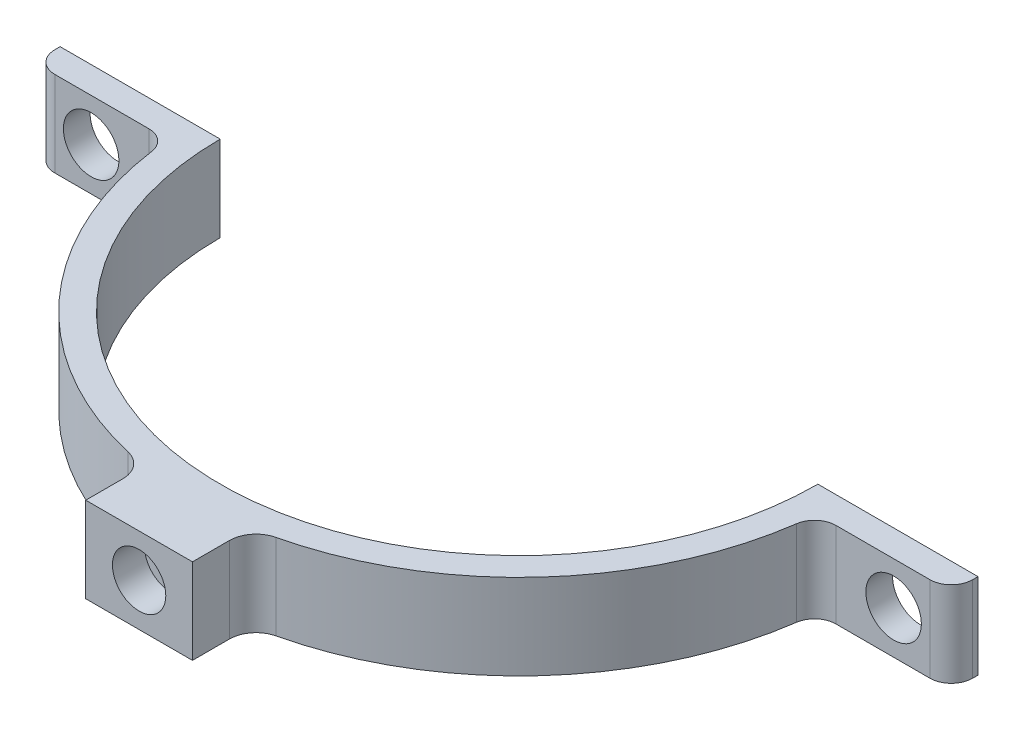
ISO-10303-21;
HEADER;
FILE_DESCRIPTION(('STEP AP214'),'2;1');
FILE_NAME('part.step','',(''),(''),'','','');
FILE_SCHEMA(('AUTOMOTIVE_DESIGN { 1 0 10303 214 1 1 1 1 }'));
ENDSEC;
DATA;
#1=APPLICATION_CONTEXT('core data for automotive mechanical design processes');
#2=APPLICATION_PROTOCOL_DEFINITION('international standard','automotive_design',2000,#1);
#3=PRODUCT_CONTEXT('',#1,'mechanical');
#4=PRODUCT('Part','Part','',(#3));
#5=PRODUCT_RELATED_PRODUCT_CATEGORY('part','',(#4));
#6=PRODUCT_DEFINITION_FORMATION('','',#4);
#7=PRODUCT_DEFINITION_CONTEXT('part definition',#1,'design');
#8=PRODUCT_DEFINITION('design','',#6,#7);
#9=PRODUCT_DEFINITION_SHAPE('','',#8);
#10=(LENGTH_UNIT() NAMED_UNIT(*) SI_UNIT(.MILLI.,.METRE.));
#11=(NAMED_UNIT(*) PLANE_ANGLE_UNIT() SI_UNIT($,.RADIAN.));
#12=(NAMED_UNIT(*) SI_UNIT($,.STERADIAN.) SOLID_ANGLE_UNIT());
#13=UNCERTAINTY_MEASURE_WITH_UNIT(LENGTH_MEASURE(1.E-05),#10,'distance_accuracy_value','');
#14=(GEOMETRIC_REPRESENTATION_CONTEXT(3) GLOBAL_UNCERTAINTY_ASSIGNED_CONTEXT((#13)) GLOBAL_UNIT_ASSIGNED_CONTEXT((#10,
#11,#12)) REPRESENTATION_CONTEXT('',''));
#15=CARTESIAN_POINT('',(0.,0.,0.));
#16=DIRECTION('',(0.,0.,1.));
#17=DIRECTION('',(1.,0.,0.));
#18=AXIS2_PLACEMENT_3D('',#15,#16,#17);
#19=CARTESIAN_POINT('',(0.,10.16,0.));
#20=DIRECTION('',(0.,-1.,0.));
#21=DIRECTION('',(0.,0.,-1.));
#22=AXIS2_PLACEMENT_3D('',#19,#20,#21);
#23=CYLINDRICAL_SURFACE('',#22,38.735);
#24=CARTESIAN_POINT('',(0.,0.,0.));
#25=DIRECTION('',(0.,1.,0.));
#26=DIRECTION('',(0.,0.,1.));
#27=AXIS2_PLACEMENT_3D('',#24,#25,#26);
#28=CIRCLE('',#27,38.735);
#29=CARTESIAN_POINT('',(-38.3618971845454,0.,5.36330769230769));
#30=VERTEX_POINT('',#29);
#31=CARTESIAN_POINT('',(-8.80340909090909,0.,37.7213495699464));
#32=VERTEX_POINT('',#31);
#33=EDGE_CURVE('E238',#30,#32,#28,.T.);
#34=ORIENTED_EDGE('',*,*,#33,.T.);
#35=DIRECTION('',(0.,-1.,0.));
#36=VECTOR('',#35,1.);
#37=CARTESIAN_POINT('',(-8.80340909090909,10.16,37.7213495699464));
#38=LINE('',#37,#36);
#39=CARTESIAN_POINT('',(-8.80340909090909,10.16,37.7213495699464));
#40=VERTEX_POINT('',#39);
#41=EDGE_CURVE('E305',#32,#40,#38,.F.);
#42=ORIENTED_EDGE('',*,*,#41,.T.);
#43=CARTESIAN_POINT('',(0.,10.16,0.));
#44=DIRECTION('',(0.,1.,0.));
#45=DIRECTION('',(0.,0.,1.));
#46=AXIS2_PLACEMENT_3D('',#43,#44,#45);
#47=CIRCLE('',#46,38.735);
#48=CARTESIAN_POINT('',(-38.3618971845454,10.16,5.36330769230769));
#49=VERTEX_POINT('',#48);
#50=EDGE_CURVE('E217',#49,#40,#47,.T.);
#51=ORIENTED_EDGE('',*,*,#50,.F.);
#52=DIRECTION('',(0.,-1.,0.));
#53=VECTOR('',#52,1.);
#54=CARTESIAN_POINT('',(-38.3618971845454,10.16,5.36330769230769));
#55=LINE('',#54,#53);
#56=EDGE_CURVE('E263',#49,#30,#55,.T.);
#57=ORIENTED_EDGE('',*,*,#56,.T.);
#58=EDGE_LOOP('',(#34,#42,#51,#57));
#59=FACE_BOUND('',#58,.T.);
#60=ADVANCED_FACE('F36',(#59),#23,.T.);
#61=CARTESIAN_POINT('',(-54.61,10.16,0.));
#62=DIRECTION('',(0.,0.,1.));
#63=DIRECTION('',(1.,0.,0.));
#64=AXIS2_PLACEMENT_3D('',#61,#62,#63);
#65=PLANE('',#64);
#66=CARTESIAN_POINT('',(-47.7437157130775,5.08,0.));
#67=DIRECTION('',(0.,0.,1.));
#68=DIRECTION('',(1.,0.,0.));
#69=AXIS2_PLACEMENT_3D('',#66,#67,#68);
#70=CIRCLE('',#69,3.302);
#71=CARTESIAN_POINT('',(-44.4417157130775,5.08,0.));
#72=VERTEX_POINT('',#71);
#73=EDGE_CURVE('E204',#72,#72,#70,.T.);
#74=ORIENTED_EDGE('',*,*,#73,.T.);
#75=EDGE_LOOP('',(#74));
#76=FACE_BOUND('',#75,.T.);
#77=DIRECTION('',(-1.,0.,0.));
#78=VECTOR('',#77,1.);
#79=CARTESIAN_POINT('',(-54.61,0.,0.));
#80=LINE('',#79,#78);
#81=CARTESIAN_POINT('',(-35.56,0.,0.));
#82=VERTEX_POINT('',#81);
#83=CARTESIAN_POINT('',(-54.61,0.,0.));
#84=VERTEX_POINT('',#83);
#85=EDGE_CURVE('E207',#82,#84,#80,.T.);
#86=ORIENTED_EDGE('',*,*,#85,.T.);
#87=DIRECTION('',(0.,-1.,0.));
#88=VECTOR('',#87,1.);
#89=CARTESIAN_POINT('',(-54.61,10.16,0.));
#90=LINE('',#89,#88);
#91=CARTESIAN_POINT('',(-54.61,10.16,0.));
#92=VERTEX_POINT('',#91);
#93=EDGE_CURVE('E257',#92,#84,#90,.T.);
#94=ORIENTED_EDGE('',*,*,#93,.F.);
#95=DIRECTION('',(-1.,0.,0.));
#96=VECTOR('',#95,1.);
#97=CARTESIAN_POINT('',(-54.61,10.16,0.));
#98=LINE('',#97,#96);
#99=CARTESIAN_POINT('',(-35.56,10.16,0.));
#100=VERTEX_POINT('',#99);
#101=EDGE_CURVE('E208',#100,#92,#98,.T.);
#102=ORIENTED_EDGE('',*,*,#101,.F.);
#103=DIRECTION('',(0.,-1.,0.));
#104=VECTOR('',#103,1.);
#105=CARTESIAN_POINT('',(-35.56,10.16,0.));
#106=LINE('',#105,#104);
#107=EDGE_CURVE('E229',#100,#82,#106,.T.);
#108=ORIENTED_EDGE('',*,*,#107,.T.);
#109=EDGE_LOOP('',(#86,#94,#102,#108));
#110=FACE_BOUND('',#109,.T.);
#111=ADVANCED_FACE('F346',(#76,#110),#65,.F.);
#112=CARTESIAN_POINT('',(-54.61,10.16,0.));
#113=DIRECTION('',(1.,0.,0.));
#114=DIRECTION('',(0.,0.,-1.));
#115=AXIS2_PLACEMENT_3D('',#112,#113,#114);
#116=PLANE('',#115);
#117=DIRECTION('',(0.,0.,1.));
#118=VECTOR('',#117,1.);
#119=CARTESIAN_POINT('',(-54.61,0.,0.));
#120=LINE('',#119,#118);
#121=CARTESIAN_POINT('',(-54.61,0.,0.635));
#122=VERTEX_POINT('',#121);
#123=EDGE_CURVE('E232',#84,#122,#120,.T.);
#124=ORIENTED_EDGE('',*,*,#123,.T.);
#125=DIRECTION('',(0.,-1.,0.));
#126=VECTOR('',#125,1.);
#127=CARTESIAN_POINT('',(-54.61,10.16,0.635));
#128=LINE('',#127,#126);
#129=CARTESIAN_POINT('',(-54.61,10.16,0.635));
#130=VERTEX_POINT('',#129);
#131=EDGE_CURVE('E291',#122,#130,#128,.F.);
#132=ORIENTED_EDGE('',*,*,#131,.T.);
#133=DIRECTION('',(0.,0.,1.));
#134=VECTOR('',#133,1.);
#135=CARTESIAN_POINT('',(-54.61,10.16,0.));
#136=LINE('',#135,#134);
#137=EDGE_CURVE('E211',#92,#130,#136,.T.);
#138=ORIENTED_EDGE('',*,*,#137,.F.);
#139=ORIENTED_EDGE('',*,*,#93,.T.);
#140=EDGE_LOOP('',(#124,#132,#138,#139));
#141=FACE_BOUND('',#140,.T.);
#142=ADVANCED_FACE('F340',(#141),#116,.F.);
#143=CARTESIAN_POINT('',(-54.61,10.16,3.175));
#144=DIRECTION('',(0.,0.,-1.));
#145=DIRECTION('',(-1.,0.,0.));
#146=AXIS2_PLACEMENT_3D('',#143,#144,#145);
#147=PLANE('',#146);
#148=CARTESIAN_POINT('',(-47.7437157130775,5.08,3.175));
#149=DIRECTION('',(0.,0.,1.));
#150=DIRECTION('',(1.,0.,0.));
#151=AXIS2_PLACEMENT_3D('',#148,#149,#150);
#152=CIRCLE('',#151,3.302);
#153=CARTESIAN_POINT('',(-44.4417157130775,5.08,3.175));
#154=VERTEX_POINT('',#153);
#155=EDGE_CURVE('E201',#154,#154,#152,.T.);
#156=ORIENTED_EDGE('',*,*,#155,.F.);
#157=EDGE_LOOP('',(#156));
#158=FACE_BOUND('',#157,.T.);
#159=DIRECTION('',(1.,0.,0.));
#160=VECTOR('',#159,1.);
#161=CARTESIAN_POINT('',(-54.61,10.16,3.175));
#162=LINE('',#161,#160);
#163=CARTESIAN_POINT('',(-52.07,10.16,3.175));
#164=VERTEX_POINT('',#163);
#165=CARTESIAN_POINT('',(-40.8774314261549,10.16,3.175));
#166=VERTEX_POINT('',#165);
#167=EDGE_CURVE('E214',#164,#166,#162,.T.);
#168=ORIENTED_EDGE('',*,*,#167,.F.);
#169=DIRECTION('',(0.,-1.,0.));
#170=VECTOR('',#169,1.);
#171=CARTESIAN_POINT('',(-52.07,10.16,3.175));
#172=LINE('',#171,#170);
#173=CARTESIAN_POINT('',(-52.07,0.,3.175));
#174=VERTEX_POINT('',#173);
#175=EDGE_CURVE('E282',#164,#174,#172,.T.);
#176=ORIENTED_EDGE('',*,*,#175,.T.);
#177=DIRECTION('',(1.,0.,0.));
#178=VECTOR('',#177,1.);
#179=CARTESIAN_POINT('',(-54.61,0.,3.175));
#180=LINE('',#179,#178);
#181=CARTESIAN_POINT('',(-40.8774314261549,0.,3.175));
#182=VERTEX_POINT('',#181);
#183=EDGE_CURVE('E235',#174,#182,#180,.T.);
#184=ORIENTED_EDGE('',*,*,#183,.T.);
#185=DIRECTION('',(0.,1.,0.));
#186=VECTOR('',#185,1.);
#187=CARTESIAN_POINT('',(-40.8774314261549,10.16,3.175));
#188=LINE('',#187,#186);
#189=EDGE_CURVE('E269',#182,#166,#188,.T.);
#190=ORIENTED_EDGE('',*,*,#189,.T.);
#191=EDGE_LOOP('',(#168,#176,#184,#190));
#192=FACE_BOUND('',#191,.T.);
#193=ADVANCED_FACE('F333',(#158,#192),#147,.F.);
#194=CARTESIAN_POINT('',(8.80340909090909,10.16,37.7213495699464));
#195=VERTEX_POINT('',#194);
#196=CARTESIAN_POINT('',(38.3618971845454,10.16,5.36330769230769));
#197=VERTEX_POINT('',#196);
#198=EDGE_CURVE('E216',#195,#197,#47,.T.);
#199=ORIENTED_EDGE('',*,*,#198,.F.);
#200=DIRECTION('',(0.,-1.,0.));
#201=VECTOR('',#200,1.);
#202=CARTESIAN_POINT('',(8.80340909090909,10.16,37.7213495699464));
#203=LINE('',#202,#201);
#204=CARTESIAN_POINT('',(8.80340909090909,0.,37.7213495699464));
#205=VERTEX_POINT('',#204);
#206=EDGE_CURVE('E51',#195,#205,#203,.T.);
#207=ORIENTED_EDGE('',*,*,#206,.T.);
#208=CARTESIAN_POINT('',(38.3618971845454,0.,5.36330769230769));
#209=VERTEX_POINT('',#208);
#210=EDGE_CURVE('E237',#205,#209,#28,.T.);
#211=ORIENTED_EDGE('',*,*,#210,.T.);
#212=DIRECTION('',(0.,-1.,0.));
#213=VECTOR('',#212,1.);
#214=CARTESIAN_POINT('',(38.3618971845454,10.16,5.36330769230769));
#215=LINE('',#214,#213);
#216=EDGE_CURVE('E266',#209,#197,#215,.F.);
#217=ORIENTED_EDGE('',*,*,#216,.T.);
#218=EDGE_LOOP('',(#199,#207,#211,#217));
#219=FACE_BOUND('',#218,.T.);
#220=ADVANCED_FACE('F388',(#219),#23,.T.);
#221=CARTESIAN_POINT('',(54.61,10.16,3.175));
#222=DIRECTION('',(0.,0.,-1.));
#223=DIRECTION('',(-1.,0.,0.));
#224=AXIS2_PLACEMENT_3D('',#221,#222,#223);
#225=PLANE('',#224);
#226=CARTESIAN_POINT('',(47.7437157130775,5.08,3.175));
#227=DIRECTION('',(0.,0.,1.));
#228=DIRECTION('',(-1.,0.,0.));
#229=AXIS2_PLACEMENT_3D('',#226,#227,#228);
#230=CIRCLE('',#229,3.302);
#231=CARTESIAN_POINT('',(44.4417157130775,5.08,3.175));
#232=VERTEX_POINT('',#231);
#233=EDGE_CURVE('E196',#232,#232,#230,.T.);
#234=ORIENTED_EDGE('',*,*,#233,.F.);
#235=EDGE_LOOP('',(#234));
#236=FACE_BOUND('',#235,.T.);
#237=DIRECTION('',(1.,0.,0.));
#238=VECTOR('',#237,1.);
#239=CARTESIAN_POINT('',(54.61,0.,3.175));
#240=LINE('',#239,#238);
#241=CARTESIAN_POINT('',(40.8774314261549,0.,3.175));
#242=VERTEX_POINT('',#241);
#243=CARTESIAN_POINT('',(52.07,0.,3.175));
#244=VERTEX_POINT('',#243);
#245=EDGE_CURVE('E241',#242,#244,#240,.T.);
#246=ORIENTED_EDGE('',*,*,#245,.T.);
#247=DIRECTION('',(0.,-1.,0.));
#248=VECTOR('',#247,1.);
#249=CARTESIAN_POINT('',(52.07,10.16,3.175));
#250=LINE('',#249,#248);
#251=CARTESIAN_POINT('',(52.07,10.16,3.175));
#252=VERTEX_POINT('',#251);
#253=EDGE_CURVE('E300',#244,#252,#250,.F.);
#254=ORIENTED_EDGE('',*,*,#253,.T.);
#255=DIRECTION('',(1.,0.,0.));
#256=VECTOR('',#255,1.);
#257=CARTESIAN_POINT('',(54.61,10.16,3.175));
#258=LINE('',#257,#256);
#259=CARTESIAN_POINT('',(40.8774314261549,10.16,3.175));
#260=VERTEX_POINT('',#259);
#261=EDGE_CURVE('E220',#260,#252,#258,.T.);
#262=ORIENTED_EDGE('',*,*,#261,.F.);
#263=DIRECTION('',(0.,1.,0.));
#264=VECTOR('',#263,1.);
#265=CARTESIAN_POINT('',(40.8774314261549,0.,3.175));
#266=LINE('',#265,#264);
#267=EDGE_CURVE('E260',#260,#242,#266,.F.);
#268=ORIENTED_EDGE('',*,*,#267,.T.);
#269=EDGE_LOOP('',(#246,#254,#262,#268));
#270=FACE_BOUND('',#269,.T.);
#271=ADVANCED_FACE('F366',(#236,#270),#225,.F.);
#272=CARTESIAN_POINT('',(54.61,10.16,0.));
#273=DIRECTION('',(-1.,0.,0.));
#274=DIRECTION('',(0.,0.,1.));
#275=AXIS2_PLACEMENT_3D('',#272,#273,#274);
#276=PLANE('',#275);
#277=DIRECTION('',(0.,0.,-1.));
#278=VECTOR('',#277,1.);
#279=CARTESIAN_POINT('',(54.61,10.16,0.));
#280=LINE('',#279,#278);
#281=CARTESIAN_POINT('',(54.61,10.16,0.635));
#282=VERTEX_POINT('',#281);
#283=CARTESIAN_POINT('',(54.61,10.16,0.));
#284=VERTEX_POINT('',#283);
#285=EDGE_CURVE('E223',#282,#284,#280,.T.);
#286=ORIENTED_EDGE('',*,*,#285,.F.);
#287=DIRECTION('',(0.,-1.,0.));
#288=VECTOR('',#287,1.);
#289=CARTESIAN_POINT('',(54.61,10.16,0.635));
#290=LINE('',#289,#288);
#291=CARTESIAN_POINT('',(54.61,0.,0.635));
#292=VERTEX_POINT('',#291);
#293=EDGE_CURVE('E297',#282,#292,#290,.T.);
#294=ORIENTED_EDGE('',*,*,#293,.T.);
#295=DIRECTION('',(0.,0.,-1.));
#296=VECTOR('',#295,1.);
#297=CARTESIAN_POINT('',(54.61,0.,0.));
#298=LINE('',#297,#296);
#299=CARTESIAN_POINT('',(54.61,0.,0.));
#300=VERTEX_POINT('',#299);
#301=EDGE_CURVE('E244',#292,#300,#298,.T.);
#302=ORIENTED_EDGE('',*,*,#301,.T.);
#303=DIRECTION('',(0.,-1.,0.));
#304=VECTOR('',#303,1.);
#305=CARTESIAN_POINT('',(54.61,10.16,0.));
#306=LINE('',#305,#304);
#307=EDGE_CURVE('E254',#284,#300,#306,.T.);
#308=ORIENTED_EDGE('',*,*,#307,.F.);
#309=EDGE_LOOP('',(#286,#294,#302,#308));
#310=FACE_BOUND('',#309,.T.);
#311=ADVANCED_FACE('F360',(#310),#276,.F.);
#312=CARTESIAN_POINT('',(54.61,10.16,0.));
#313=DIRECTION('',(0.,0.,1.));
#314=DIRECTION('',(1.,0.,0.));
#315=AXIS2_PLACEMENT_3D('',#312,#313,#314);
#316=PLANE('',#315);
#317=CARTESIAN_POINT('',(47.7437157130775,5.08,0.));
#318=DIRECTION('',(0.,0.,1.));
#319=DIRECTION('',(1.,0.,0.));
#320=AXIS2_PLACEMENT_3D('',#317,#318,#319);
#321=CIRCLE('',#320,3.302);
#322=CARTESIAN_POINT('',(51.0457157130775,5.08,0.));
#323=VERTEX_POINT('',#322);
#324=EDGE_CURVE('E200',#323,#323,#321,.T.);
#325=ORIENTED_EDGE('',*,*,#324,.T.);
#326=EDGE_LOOP('',(#325));
#327=FACE_BOUND('',#326,.T.);
#328=DIRECTION('',(-1.,0.,0.));
#329=VECTOR('',#328,1.);
#330=CARTESIAN_POINT('',(54.61,0.,0.));
#331=LINE('',#330,#329);
#332=CARTESIAN_POINT('',(35.56,0.,0.));
#333=VERTEX_POINT('',#332);
#334=EDGE_CURVE('E246',#300,#333,#331,.T.);
#335=ORIENTED_EDGE('',*,*,#334,.T.);
#336=DIRECTION('',(0.,-1.,0.));
#337=VECTOR('',#336,1.);
#338=CARTESIAN_POINT('',(35.56,10.16,0.));
#339=LINE('',#338,#337);
#340=CARTESIAN_POINT('',(35.56,10.16,0.));
#341=VERTEX_POINT('',#340);
#342=EDGE_CURVE('E251',#341,#333,#339,.T.);
#343=ORIENTED_EDGE('',*,*,#342,.F.);
#344=DIRECTION('',(-1.,0.,0.));
#345=VECTOR('',#344,1.);
#346=CARTESIAN_POINT('',(54.61,10.16,0.));
#347=LINE('',#346,#345);
#348=EDGE_CURVE('E225',#284,#341,#347,.T.);
#349=ORIENTED_EDGE('',*,*,#348,.F.);
#350=ORIENTED_EDGE('',*,*,#307,.T.);
#351=EDGE_LOOP('',(#335,#343,#349,#350));
#352=FACE_BOUND('',#351,.T.);
#353=ADVANCED_FACE('F356',(#327,#352),#316,.F.);
#354=CARTESIAN_POINT('',(0.,10.16,0.));
#355=DIRECTION('',(0.,-1.,0.));
#356=DIRECTION('',(0.,0.,-1.));
#357=AXIS2_PLACEMENT_3D('',#354,#355,#356);
#358=CYLINDRICAL_SURFACE('',#357,35.56);
#359=CARTESIAN_POINT('',(1.905,5.08,35.5089365512402));
#360=CARTESIAN_POINT('',(1.90499528472008,5.18692228117183,35.5089372364535));
#361=CARTESIAN_POINT('',(1.89596789195151,5.29392013652907,35.5094246791965));
#362=CARTESIAN_POINT('',(1.86008427098337,5.50496341607905,35.511322094049));
#363=CARTESIAN_POINT('',(1.83320710297335,5.60900522283093,35.512733149633));
#364=CARTESIAN_POINT('',(1.76239632684582,5.81104873776803,35.5163174985534));
#365=CARTESIAN_POINT('',(1.71847149476324,5.90905352374463,35.5184903996409));
#366=CARTESIAN_POINT('',(1.61482592213845,6.09627255317736,35.5233531035937));
#367=CARTESIAN_POINT('',(1.55510888078067,6.18548884855084,35.5260427853674));
#368=CARTESIAN_POINT('',(1.42149852788384,6.3527265211885,35.5316394756835));
#369=CARTESIAN_POINT('',(1.34759107856138,6.43073659714062,35.5345466991831));
#370=CARTESIAN_POINT('',(1.1877264293164,6.57325094402159,35.5402488695982));
#371=CARTESIAN_POINT('',(1.1017687349729,6.63775466051423,35.5430438119008));
#372=CARTESIAN_POINT('',(0.920183110619924,6.75145743189595,35.5482081866555));
#373=CARTESIAN_POINT('',(0.824549563039175,6.80064752771499,35.5505773696804));
#374=CARTESIAN_POINT('',(0.626366425372464,6.88226927439299,35.5546210534798));
#375=CARTESIAN_POINT('',(0.523816893334186,6.91470106588903,35.5562955600841));
#376=CARTESIAN_POINT('',(0.314818173610702,6.96185530194709,35.558759746413));
#377=CARTESIAN_POINT('',(0.20837286243692,6.97659488267924,35.5595502822756));
#378=CARTESIAN_POINT('',(-0.00548384335887839,6.98799918843273,35.5601603192589));
#379=CARTESIAN_POINT('',(-0.112895229504896,6.98466407188091,35.5599798288907));
#380=CARTESIAN_POINT('',(-0.325519028124928,6.96002785091205,35.5586688713163));
#381=CARTESIAN_POINT('',(-0.430733584175958,6.93874518764603,35.5575393792162));
#382=CARTESIAN_POINT('',(-0.636094555524925,6.87884660482394,35.5544587485384));
#383=CARTESIAN_POINT('',(-0.736240947264356,6.84023060470502,35.5525076061418));
#384=CARTESIAN_POINT('',(-0.928682135765586,6.74674052600603,35.5480017530836));
#385=CARTESIAN_POINT('',(-1.02097284880108,6.69185805704333,35.5454467310738));
#386=CARTESIAN_POINT('',(-1.19503826158936,6.56739907308148,35.5400208045938));
#387=CARTESIAN_POINT('',(-1.27681287547021,6.49782243810556,35.5371498975443));
#388=CARTESIAN_POINT('',(-1.42763238234537,6.3458459216652,35.5314111958887));
#389=CARTESIAN_POINT('',(-1.49666115283665,6.26343003910182,35.5285434097246));
#390=CARTESIAN_POINT('',(-1.61990527078437,6.08817068346563,35.5231378774802));
#391=CARTESIAN_POINT('',(-1.67412061384806,5.99532720730066,35.5206001314976));
#392=CARTESIAN_POINT('',(-1.76619756330588,5.80183828218134,35.5161411425838));
#393=CARTESIAN_POINT('',(-1.80405854429074,5.70119253503291,35.51421992323));
#394=CARTESIAN_POINT('',(-1.8623411717286,5.49496050500376,35.5112115301529));
#395=CARTESIAN_POINT('',(-1.88276296876006,5.38937426478999,35.5101243492282));
#396=CARTESIAN_POINT('',(-1.90556754969987,5.17639894831174,35.5089079722278));
#397=CARTESIAN_POINT('',(-1.9079727198572,5.06901227556972,35.5087775873059));
#398=CARTESIAN_POINT('',(-1.89473421124394,4.85536090898705,35.5094864017177));
#399=CARTESIAN_POINT('',(-1.87909060114982,4.74909621087877,35.5103255973622));
#400=CARTESIAN_POINT('',(-1.83021717112101,4.5407682512432,35.5128779058467));
#401=CARTESIAN_POINT('',(-1.79699761440236,4.43870257520637,35.5145905086522));
#402=CARTESIAN_POINT('',(-1.71392566120622,4.2415955113014,35.518696179825));
#403=CARTESIAN_POINT('',(-1.66407315406259,4.14655417017431,35.5210892527196));
#404=CARTESIAN_POINT('',(-1.54909304006169,3.96609070184129,35.5262890450569));
#405=CARTESIAN_POINT('',(-1.48395040560363,3.8806781611546,35.5290961704277));
#406=CARTESIAN_POINT('',(-1.34026112994299,3.72199331038301,35.5348062640108));
#407=CARTESIAN_POINT('',(-1.26171439108921,3.64872108875009,35.5377092329211));
#408=CARTESIAN_POINT('',(-1.09335035731805,3.51632147543486,35.543287313347));
#409=CARTESIAN_POINT('',(-1.00352167690863,3.45720855071697,35.5459621900328));
#410=CARTESIAN_POINT('',(-0.815201135850563,3.35490445442333,35.5507792777332));
#411=CARTESIAN_POINT('',(-0.716709317070738,3.31171320590359,35.5529214913218));
#412=CARTESIAN_POINT('',(-0.513911971191804,3.24250376564327,35.5564307153817));
#413=CARTESIAN_POINT('',(-0.40960960117195,3.21647634499573,35.557798142396));
#414=CARTESIAN_POINT('',(-0.198107793913434,3.18230316589262,35.559605350478));
#415=CARTESIAN_POINT('',(-0.0909083762213108,3.17415728681979,35.5600451378029));
#416=CARTESIAN_POINT('',(0.123201053286721,3.17597956594214,35.5599475309231));
#417=CARTESIAN_POINT('',(0.230111259417535,3.18592504578516,35.5594113601264));
#418=CARTESIAN_POINT('',(0.440741693534696,3.22360080878797,35.5574245953351));
#419=CARTESIAN_POINT('',(0.54446191560543,3.25133112492648,35.5559739996449));
#420=CARTESIAN_POINT('',(0.745772488208633,3.32378461150011,35.5523215444285));
#421=CARTESIAN_POINT('',(0.843362813559292,3.36850785173739,35.5501196818164));
#422=CARTESIAN_POINT('',(1.02965152210561,3.47367399495687,35.5452122134895));
#423=CARTESIAN_POINT('',(1.11835016698447,3.53411643513288,35.5425066226061));
#424=CARTESIAN_POINT('',(1.28445158281622,3.66908736503737,35.5368922478863));
#425=CARTESIAN_POINT('',(1.36184133317962,3.74363186830167,35.5339832354459));
#426=CARTESIAN_POINT('',(1.50303300973831,3.90467647086567,35.528291531182));
#427=CARTESIAN_POINT('',(1.56683159289172,3.9911795030166,35.5255088705694));
#428=CARTESIAN_POINT('',(1.6790643814748,4.17376176449839,35.5203816463977));
#429=CARTESIAN_POINT('',(1.72748264529907,4.26985079502285,35.5180375384229));
#430=CARTESIAN_POINT('',(1.80744067870859,4.46873542333644,35.5140588487145));
#431=CARTESIAN_POINT('',(1.83900034074567,4.57152295569532,35.5124234311878));
#432=CARTESIAN_POINT('',(1.87608693681715,4.74245548090203,35.5104786008033));
#433=CARTESIAN_POINT('',(1.88691544621223,4.80949388206176,35.5099028913728));
#434=CARTESIAN_POINT('',(1.90137347016385,4.94434471398388,35.5091316493941));
#435=CARTESIAN_POINT('',(1.90500299187459,5.01215714397698,35.508936116468));
#436=CARTESIAN_POINT('',(1.905,5.08,35.5089365512402));
#437=B_SPLINE_CURVE_WITH_KNOTS('',3,(#359,#360,#361,#362,#363,#364,#365,#366,#367,#368,#369,
#370,#371,#372,#373,#374,#375,#376,#377,#378,#379,#380,#381,#382,#383,#384,#385,#386,#387,#388,
#389,#390,#391,#392,#393,#394,#395,#396,#397,#398,#399,#400,#401,#402,#403,#404,#405,#406,#407,
#408,#409,#410,#411,#412,#413,#414,#415,#416,#417,#418,#419,#420,#421,#422,#423,#424,#425,#426,
#427,#428,#429,#430,#431,#432,#433,#434,#435,#436),.UNSPECIFIED.,.T.,.F.,(4,2,2,2,2,2,2,2,2,2,2,
2,2,2,2,2,2,2,2,2,2,2,2,2,2,2,2,2,2,2,2,2,2,2,2,2,2,2,4),(0.,0.320519186760134,
0.641415044622191,0.962145925876536,1.28280174522127,1.60377870467998,1.92476883766446,
2.2459464111106,2.56712128916393,2.88798483473185,3.20884556789796,3.52937701696115,
3.84990995582384,4.17060851688486,4.49130969652666,4.81241380010056,5.13351799889392,
5.45463447598739,5.77574818037558,6.09646282418142,6.41717624765663,6.73770260159183,
7.05823108816852,7.37907592880361,7.69992310694803,8.02109671883048,8.34226877857095,
8.66326800453947,8.98426506524909,9.30486001860617,9.62545556644929,9.94605243122293,
10.2666398580214,10.5875935357309,10.9086260680272,11.2299902709412,11.5509744350754,
11.7543460654908,11.9577174937999),.UNSPECIFIED.);
#438=CARTESIAN_POINT('',(1.905,5.08,35.5089365512402));
#439=VERTEX_POINT('',#438);
#440=EDGE_CURVE('E444',#439,#439,#437,.T.);
#441=ORIENTED_EDGE('',*,*,#440,.T.);
#442=EDGE_LOOP('',(#441));
#443=FACE_BOUND('',#442,.T.);
#444=CARTESIAN_POINT('',(0.,0.,0.));
#445=DIRECTION('',(0.,-1.,0.));
#446=DIRECTION('',(0.,0.,1.));
#447=AXIS2_PLACEMENT_3D('',#444,#445,#446);
#448=CIRCLE('',#447,35.56);
#449=EDGE_CURVE('E212',#333,#82,#448,.T.);
#450=ORIENTED_EDGE('',*,*,#449,.T.);
#451=ORIENTED_EDGE('',*,*,#107,.F.);
#452=CARTESIAN_POINT('',(0.,10.16,0.));
#453=DIRECTION('',(0.,-1.,0.));
#454=DIRECTION('',(0.,0.,1.));
#455=AXIS2_PLACEMENT_3D('',#452,#453,#454);
#456=CIRCLE('',#455,35.56);
#457=EDGE_CURVE('E227',#341,#100,#456,.T.);
#458=ORIENTED_EDGE('',*,*,#457,.F.);
#459=ORIENTED_EDGE('',*,*,#342,.T.);
#460=EDGE_LOOP('',(#450,#451,#458,#459));
#461=FACE_BOUND('',#460,.T.);
#462=ADVANCED_FACE('F352',(#443,#461),#358,.F.);
#463=CARTESIAN_POINT('',(0.,10.16,0.));
#464=DIRECTION('',(0.,1.,0.));
#465=DIRECTION('',(0.,0.,1.));
#466=AXIS2_PLACEMENT_3D('',#463,#464,#465);
#467=PLANE('',#466);
#468=ORIENTED_EDGE('',*,*,#137,.T.);
#469=CARTESIAN_POINT('',(-52.07,10.16,0.635));
#470=DIRECTION('',(0.,1.,0.));
#471=DIRECTION('',(0.,0.,1.));
#472=AXIS2_PLACEMENT_3D('',#469,#470,#471);
#473=CIRCLE('',#472,2.54);
#474=EDGE_CURVE('E295',#130,#164,#473,.T.);
#475=ORIENTED_EDGE('',*,*,#474,.T.);
#476=ORIENTED_EDGE('',*,*,#167,.T.);
#477=CARTESIAN_POINT('',(-40.8774314261549,10.16,5.715));
#478=DIRECTION('',(0.,1.,0.));
#479=DIRECTION('',(0.,0.,1.));
#480=AXIS2_PLACEMENT_3D('',#477,#478,#479);
#481=CIRCLE('',#480,2.54);
#482=EDGE_CURVE('E280',#166,#49,#481,.F.);
#483=ORIENTED_EDGE('',*,*,#482,.T.);
#484=ORIENTED_EDGE('',*,*,#50,.T.);
#485=CARTESIAN_POINT('',(-9.525,10.16,40.8132634691224));
#486=DIRECTION('',(0.,1.,0.));
#487=DIRECTION('',(0.,0.,1.));
#488=AXIS2_PLACEMENT_3D('',#485,#486,#487);
#489=CIRCLE('',#488,3.175);
#490=CARTESIAN_POINT('',(-6.35,10.16,40.8132634691224));
#491=VERTEX_POINT('',#490);
#492=EDGE_CURVE('E311',#40,#491,#489,.F.);
#493=ORIENTED_EDGE('',*,*,#492,.T.);
#494=DIRECTION('',(0.,0.,1.));
#495=VECTOR('',#494,1.);
#496=CARTESIAN_POINT('',(-6.35,10.16,-0.00100000000000794));
#497=LINE('',#496,#495);
#498=CARTESIAN_POINT('',(-6.35,10.16,45.212));
#499=VERTEX_POINT('',#498);
#500=EDGE_CURVE('E175',#491,#499,#497,.T.);
#501=ORIENTED_EDGE('',*,*,#500,.T.);
#502=DIRECTION('',(-1.,0.,0.));
#503=VECTOR('',#502,1.);
#504=CARTESIAN_POINT('',(-6.35,10.16,45.212));
#505=LINE('',#504,#503);
#506=CARTESIAN_POINT('',(6.35,10.16,45.212));
#507=VERTEX_POINT('',#506);
#508=EDGE_CURVE('E171',#507,#499,#505,.T.);
#509=ORIENTED_EDGE('',*,*,#508,.F.);
#510=DIRECTION('',(0.,0.,1.));
#511=VECTOR('',#510,1.);
#512=CARTESIAN_POINT('',(6.35,10.16,-0.00100000000000794));
#513=LINE('',#512,#511);
#514=CARTESIAN_POINT('',(6.35,10.16,40.8132634691224));
#515=VERTEX_POINT('',#514);
#516=EDGE_CURVE('E159',#515,#507,#513,.T.);
#517=ORIENTED_EDGE('',*,*,#516,.F.);
#518=CARTESIAN_POINT('',(9.525,10.16,40.8132634691224));
#519=DIRECTION('',(0.,1.,0.));
#520=DIRECTION('',(0.,0.,1.));
#521=AXIS2_PLACEMENT_3D('',#518,#519,#520);
#522=CIRCLE('',#521,3.175);
#523=EDGE_CURVE('E44',#515,#195,#522,.F.);
#524=ORIENTED_EDGE('',*,*,#523,.T.);
#525=ORIENTED_EDGE('',*,*,#198,.T.);
#526=CARTESIAN_POINT('',(40.8774314261549,10.16,5.715));
#527=DIRECTION('',(0.,1.,0.));
#528=DIRECTION('',(0.,0.,1.));
#529=AXIS2_PLACEMENT_3D('',#526,#527,#528);
#530=CIRCLE('',#529,2.54);
#531=EDGE_CURVE('E275',#197,#260,#530,.F.);
#532=ORIENTED_EDGE('',*,*,#531,.T.);
#533=ORIENTED_EDGE('',*,*,#261,.T.);
#534=CARTESIAN_POINT('',(52.07,10.16,0.635));
#535=DIRECTION('',(0.,1.,0.));
#536=DIRECTION('',(0.,0.,1.));
#537=AXIS2_PLACEMENT_3D('',#534,#535,#536);
#538=CIRCLE('',#537,2.54);
#539=EDGE_CURVE('E293',#252,#282,#538,.T.);
#540=ORIENTED_EDGE('',*,*,#539,.T.);
#541=ORIENTED_EDGE('',*,*,#285,.T.);
#542=ORIENTED_EDGE('',*,*,#348,.T.);
#543=ORIENTED_EDGE('',*,*,#457,.T.);
#544=ORIENTED_EDGE('',*,*,#101,.T.);
#545=EDGE_LOOP('',(#468,#475,#476,#483,#484,#493,#501,#509,#517,#524,#525,#532,#533,#540,#541,
#542,#543,#544));
#546=FACE_BOUND('',#545,.T.);
#547=ADVANCED_FACE('F173',(#546),#467,.T.);
#548=CARTESIAN_POINT('',(0.,0.,0.));
#549=DIRECTION('',(0.,1.,0.));
#550=DIRECTION('',(0.,0.,1.));
#551=AXIS2_PLACEMENT_3D('',#548,#549,#550);
#552=PLANE('',#551);
#553=ORIENTED_EDGE('',*,*,#183,.F.);
#554=CARTESIAN_POINT('',(-52.07,0.,0.635));
#555=DIRECTION('',(0.,1.,0.));
#556=DIRECTION('',(0.,0.,1.));
#557=AXIS2_PLACEMENT_3D('',#554,#555,#556);
#558=CIRCLE('',#557,2.54);
#559=EDGE_CURVE('E289',#174,#122,#558,.F.);
#560=ORIENTED_EDGE('',*,*,#559,.T.);
#561=ORIENTED_EDGE('',*,*,#123,.F.);
#562=ORIENTED_EDGE('',*,*,#85,.F.);
#563=ORIENTED_EDGE('',*,*,#449,.F.);
#564=ORIENTED_EDGE('',*,*,#334,.F.);
#565=ORIENTED_EDGE('',*,*,#301,.F.);
#566=CARTESIAN_POINT('',(52.07,0.,0.635));
#567=DIRECTION('',(0.,1.,0.));
#568=DIRECTION('',(0.,0.,1.));
#569=AXIS2_PLACEMENT_3D('',#566,#567,#568);
#570=CIRCLE('',#569,2.54);
#571=EDGE_CURVE('E287',#292,#244,#570,.F.);
#572=ORIENTED_EDGE('',*,*,#571,.T.);
#573=ORIENTED_EDGE('',*,*,#245,.F.);
#574=CARTESIAN_POINT('',(40.8774314261549,0.,5.715));
#575=DIRECTION('',(0.,1.,0.));
#576=DIRECTION('',(0.,0.,1.));
#577=AXIS2_PLACEMENT_3D('',#574,#575,#576);
#578=CIRCLE('',#577,2.54);
#579=EDGE_CURVE('E272',#242,#209,#578,.T.);
#580=ORIENTED_EDGE('',*,*,#579,.T.);
#581=ORIENTED_EDGE('',*,*,#210,.F.);
#582=CARTESIAN_POINT('',(9.525,0.,40.8132634691224));
#583=DIRECTION('',(0.,1.,0.));
#584=DIRECTION('',(0.,0.,1.));
#585=AXIS2_PLACEMENT_3D('',#582,#583,#584);
#586=CIRCLE('',#585,3.175);
#587=CARTESIAN_POINT('',(6.35,0.,40.8132634691224));
#588=VERTEX_POINT('',#587);
#589=EDGE_CURVE('E11',#205,#588,#586,.T.);
#590=ORIENTED_EDGE('',*,*,#589,.T.);
#591=DIRECTION('',(0.,0.,1.));
#592=VECTOR('',#591,1.);
#593=CARTESIAN_POINT('',(6.35,0.,-0.00100000000000794));
#594=LINE('',#593,#592);
#595=CARTESIAN_POINT('',(6.35,0.,45.212));
#596=VERTEX_POINT('',#595);
#597=EDGE_CURVE('E167',#588,#596,#594,.T.);
#598=ORIENTED_EDGE('',*,*,#597,.T.);
#599=DIRECTION('',(1.,0.,0.));
#600=VECTOR('',#599,1.);
#601=CARTESIAN_POINT('',(-6.35,0.,45.212));
#602=LINE('',#601,#600);
#603=CARTESIAN_POINT('',(-6.35,0.,45.212));
#604=VERTEX_POINT('',#603);
#605=EDGE_CURVE('E184',#604,#596,#602,.T.);
#606=ORIENTED_EDGE('',*,*,#605,.F.);
#607=DIRECTION('',(0.,0.,1.));
#608=VECTOR('',#607,1.);
#609=CARTESIAN_POINT('',(-6.35,0.,-0.00100000000000794));
#610=LINE('',#609,#608);
#611=CARTESIAN_POINT('',(-6.35,0.,40.8132634691224));
#612=VERTEX_POINT('',#611);
#613=EDGE_CURVE('E168',#612,#604,#610,.T.);
#614=ORIENTED_EDGE('',*,*,#613,.F.);
#615=CARTESIAN_POINT('',(-9.525,0.,40.8132634691224));
#616=DIRECTION('',(0.,1.,0.));
#617=DIRECTION('',(0.,0.,1.));
#618=AXIS2_PLACEMENT_3D('',#615,#616,#617);
#619=CIRCLE('',#618,3.175);
#620=EDGE_CURVE('E309',#612,#32,#619,.T.);
#621=ORIENTED_EDGE('',*,*,#620,.T.);
#622=ORIENTED_EDGE('',*,*,#33,.F.);
#623=CARTESIAN_POINT('',(-40.8774314261549,0.,5.715));
#624=DIRECTION('',(0.,1.,0.));
#625=DIRECTION('',(0.,0.,1.));
#626=AXIS2_PLACEMENT_3D('',#623,#624,#625);
#627=CIRCLE('',#626,2.54);
#628=EDGE_CURVE('E277',#30,#182,#627,.T.);
#629=ORIENTED_EDGE('',*,*,#628,.T.);
#630=EDGE_LOOP('',(#553,#560,#561,#562,#563,#564,#565,#572,#573,#580,#581,#590,#598,#606,#614,
#621,#622,#629));
#631=FACE_BOUND('',#630,.T.);
#632=ADVANCED_FACE('F324',(#631),#552,.F.);
#633=CARTESIAN_POINT('',(40.8774314261549,10.16,5.715));
#634=DIRECTION('',(0.,-1.,0.));
#635=DIRECTION('',(0.,0.,-1.));
#636=AXIS2_PLACEMENT_3D('',#633,#634,#635);
#637=CYLINDRICAL_SURFACE('',#636,2.54);
#638=ORIENTED_EDGE('',*,*,#531,.F.);
#639=ORIENTED_EDGE('',*,*,#216,.F.);
#640=ORIENTED_EDGE('',*,*,#579,.F.);
#641=ORIENTED_EDGE('',*,*,#267,.F.);
#642=EDGE_LOOP('',(#638,#639,#640,#641));
#643=FACE_BOUND('',#642,.T.);
#644=ADVANCED_FACE('F373',(#643),#637,.F.);
#645=CARTESIAN_POINT('',(-40.8774314261549,10.16,5.715));
#646=DIRECTION('',(0.,-1.,0.));
#647=DIRECTION('',(0.,0.,-1.));
#648=AXIS2_PLACEMENT_3D('',#645,#646,#647);
#649=CYLINDRICAL_SURFACE('',#648,2.54);
#650=ORIENTED_EDGE('',*,*,#482,.F.);
#651=ORIENTED_EDGE('',*,*,#189,.F.);
#652=ORIENTED_EDGE('',*,*,#628,.F.);
#653=ORIENTED_EDGE('',*,*,#56,.F.);
#654=EDGE_LOOP('',(#650,#651,#652,#653));
#655=FACE_BOUND('',#654,.T.);
#656=ADVANCED_FACE('F329',(#655),#649,.F.);
#657=CARTESIAN_POINT('',(-47.7437157130775,5.08,-6.985));
#658=DIRECTION('',(0.,0.,1.));
#659=DIRECTION('',(1.,0.,0.));
#660=AXIS2_PLACEMENT_3D('',#657,#658,#659);
#661=CYLINDRICAL_SURFACE('',#660,3.302);
#662=ORIENTED_EDGE('',*,*,#155,.T.);
#663=EDGE_LOOP('',(#662));
#664=FACE_BOUND('',#663,.T.);
#665=ORIENTED_EDGE('',*,*,#73,.F.);
#666=EDGE_LOOP('',(#665));
#667=FACE_BOUND('',#666,.T.);
#668=ADVANCED_FACE('F413',(#664,#667),#661,.F.);
#669=CARTESIAN_POINT('',(47.7437157130775,5.08,-6.985));
#670=DIRECTION('',(0.,0.,1.));
#671=DIRECTION('',(1.,0.,0.));
#672=AXIS2_PLACEMENT_3D('',#669,#670,#671);
#673=CYLINDRICAL_SURFACE('',#672,3.302);
#674=ORIENTED_EDGE('',*,*,#233,.T.);
#675=EDGE_LOOP('',(#674));
#676=FACE_BOUND('',#675,.T.);
#677=ORIENTED_EDGE('',*,*,#324,.F.);
#678=EDGE_LOOP('',(#677));
#679=FACE_BOUND('',#678,.T.);
#680=ADVANCED_FACE('F416',(#676,#679),#673,.F.);
#681=CARTESIAN_POINT('',(-52.07,10.16,0.635));
#682=DIRECTION('',(0.,-1.,0.));
#683=DIRECTION('',(0.,0.,-1.));
#684=AXIS2_PLACEMENT_3D('',#681,#682,#683);
#685=CYLINDRICAL_SURFACE('',#684,2.54);
#686=ORIENTED_EDGE('',*,*,#474,.F.);
#687=ORIENTED_EDGE('',*,*,#131,.F.);
#688=ORIENTED_EDGE('',*,*,#559,.F.);
#689=ORIENTED_EDGE('',*,*,#175,.F.);
#690=EDGE_LOOP('',(#686,#687,#688,#689));
#691=FACE_BOUND('',#690,.T.);
#692=ADVANCED_FACE('F337',(#691),#685,.T.);
#693=CARTESIAN_POINT('',(52.07,10.16,0.635));
#694=DIRECTION('',(0.,-1.,0.));
#695=DIRECTION('',(0.,0.,-1.));
#696=AXIS2_PLACEMENT_3D('',#693,#694,#695);
#697=CYLINDRICAL_SURFACE('',#696,2.54);
#698=ORIENTED_EDGE('',*,*,#539,.F.);
#699=ORIENTED_EDGE('',*,*,#253,.F.);
#700=ORIENTED_EDGE('',*,*,#571,.F.);
#701=ORIENTED_EDGE('',*,*,#293,.F.);
#702=EDGE_LOOP('',(#698,#699,#700,#701));
#703=FACE_BOUND('',#702,.T.);
#704=ADVANCED_FACE('F370',(#703),#697,.T.);
#705=CARTESIAN_POINT('',(6.35,0.,-0.00100000000000794));
#706=DIRECTION('',(1.,0.,0.));
#707=DIRECTION('',(0.,1.,0.));
#708=AXIS2_PLACEMENT_3D('',#705,#706,#707);
#709=PLANE('',#708);
#710=ORIENTED_EDGE('',*,*,#597,.F.);
#711=DIRECTION('',(0.,-1.,0.));
#712=VECTOR('',#711,1.);
#713=CARTESIAN_POINT('',(6.35,0.,40.8132634691224));
#714=LINE('',#713,#712);
#715=EDGE_CURVE('E166',#588,#515,#714,.F.);
#716=ORIENTED_EDGE('',*,*,#715,.T.);
#717=ORIENTED_EDGE('',*,*,#516,.T.);
#718=DIRECTION('',(0.,1.,0.));
#719=VECTOR('',#718,1.);
#720=CARTESIAN_POINT('',(6.35,0.,45.212));
#721=LINE('',#720,#719);
#722=EDGE_CURVE('E164',#596,#507,#721,.T.);
#723=ORIENTED_EDGE('',*,*,#722,.F.);
#724=EDGE_LOOP('',(#710,#716,#717,#723));
#725=FACE_BOUND('',#724,.T.);
#726=ADVANCED_FACE('F162',(#725),#709,.T.);
#727=CARTESIAN_POINT('',(-6.35,0.,-0.00100000000000794));
#728=DIRECTION('',(-1.,0.,0.));
#729=DIRECTION('',(0.,0.,1.));
#730=AXIS2_PLACEMENT_3D('',#727,#728,#729);
#731=PLANE('',#730);
#732=ORIENTED_EDGE('',*,*,#500,.F.);
#733=DIRECTION('',(0.,-1.,0.));
#734=VECTOR('',#733,1.);
#735=CARTESIAN_POINT('',(-6.35,0.,40.8132634691224));
#736=LINE('',#735,#734);
#737=EDGE_CURVE('E302',#491,#612,#736,.T.);
#738=ORIENTED_EDGE('',*,*,#737,.T.);
#739=ORIENTED_EDGE('',*,*,#613,.T.);
#740=DIRECTION('',(0.,-1.,0.));
#741=VECTOR('',#740,1.);
#742=CARTESIAN_POINT('',(-6.35,0.,45.212));
#743=LINE('',#742,#741);
#744=EDGE_CURVE('E179',#499,#604,#743,.T.);
#745=ORIENTED_EDGE('',*,*,#744,.F.);
#746=EDGE_LOOP('',(#732,#738,#739,#745));
#747=FACE_BOUND('',#746,.T.);
#748=ADVANCED_FACE('F318',(#747),#731,.T.);
#749=CARTESIAN_POINT('',(0.,0.,45.212));
#750=DIRECTION('',(0.,0.,-1.));
#751=DIRECTION('',(-1.,0.,0.));
#752=AXIS2_PLACEMENT_3D('',#749,#750,#751);
#753=PLANE('',#752);
#754=CARTESIAN_POINT('',(0.,5.08,45.212));
#755=DIRECTION('',(0.,0.,1.));
#756=DIRECTION('',(1.,0.,0.));
#757=AXIS2_PLACEMENT_3D('',#754,#755,#756);
#758=CIRCLE('',#757,3.175);
#759=CARTESIAN_POINT('',(3.175,5.08,45.212));
#760=VERTEX_POINT('',#759);
#761=EDGE_CURVE('E188',#760,#760,#758,.T.);
#762=ORIENTED_EDGE('',*,*,#761,.F.);
#763=EDGE_LOOP('',(#762));
#764=FACE_BOUND('',#763,.T.);
#765=ORIENTED_EDGE('',*,*,#722,.T.);
#766=ORIENTED_EDGE('',*,*,#508,.T.);
#767=ORIENTED_EDGE('',*,*,#744,.T.);
#768=ORIENTED_EDGE('',*,*,#605,.T.);
#769=EDGE_LOOP('',(#765,#766,#767,#768));
#770=FACE_BOUND('',#769,.T.);
#771=ADVANCED_FACE('F182',(#764,#770),#753,.F.);
#772=CARTESIAN_POINT('',(-9.525,10.16,40.8132634691224));
#773=DIRECTION('',(0.,-1.,0.));
#774=DIRECTION('',(0.,0.,-1.));
#775=AXIS2_PLACEMENT_3D('',#772,#773,#774);
#776=CYLINDRICAL_SURFACE('',#775,3.175);
#777=ORIENTED_EDGE('',*,*,#492,.F.);
#778=ORIENTED_EDGE('',*,*,#41,.F.);
#779=ORIENTED_EDGE('',*,*,#620,.F.);
#780=ORIENTED_EDGE('',*,*,#737,.F.);
#781=EDGE_LOOP('',(#777,#778,#779,#780));
#782=FACE_BOUND('',#781,.T.);
#783=ADVANCED_FACE('F320',(#782),#776,.F.);
#784=CARTESIAN_POINT('',(9.525,10.16,40.8132634691224));
#785=DIRECTION('',(0.,-1.,0.));
#786=DIRECTION('',(0.,0.,-1.));
#787=AXIS2_PLACEMENT_3D('',#784,#785,#786);
#788=CYLINDRICAL_SURFACE('',#787,3.175);
#789=ORIENTED_EDGE('',*,*,#589,.F.);
#790=ORIENTED_EDGE('',*,*,#206,.F.);
#791=ORIENTED_EDGE('',*,*,#523,.F.);
#792=ORIENTED_EDGE('',*,*,#715,.F.);
#793=EDGE_LOOP('',(#789,#790,#791,#792));
#794=FACE_BOUND('',#793,.T.);
#795=ADVANCED_FACE('F38',(#794),#788,.F.);
#796=CARTESIAN_POINT('',(0.,5.08,41.402));
#797=DIRECTION('',(0.,0.,1.));
#798=DIRECTION('',(1.,0.,0.));
#799=AXIS2_PLACEMENT_3D('',#796,#797,#798);
#800=CYLINDRICAL_SURFACE('',#799,3.175);
#801=CARTESIAN_POINT('',(0.,5.08,41.402));
#802=DIRECTION('',(0.,0.,1.));
#803=DIRECTION('',(1.,0.,0.));
#804=AXIS2_PLACEMENT_3D('',#801,#802,#803);
#805=CIRCLE('',#804,3.175);
#806=CARTESIAN_POINT('',(3.175,5.08,41.402));
#807=VERTEX_POINT('',#806);
#808=EDGE_CURVE('E185',#807,#807,#805,.T.);
#809=ORIENTED_EDGE('',*,*,#808,.F.);
#810=EDGE_LOOP('',(#809));
#811=FACE_BOUND('',#810,.T.);
#812=ORIENTED_EDGE('',*,*,#761,.T.);
#813=EDGE_LOOP('',(#812));
#814=FACE_BOUND('',#813,.T.);
#815=ADVANCED_FACE('F378',(#811,#814),#800,.F.);
#816=CARTESIAN_POINT('',(0.,5.08,41.402));
#817=DIRECTION('',(0.,0.,1.));
#818=DIRECTION('',(1.,0.,0.));
#819=AXIS2_PLACEMENT_3D('',#816,#817,#818);
#820=PLANE('',#819);
#821=CARTESIAN_POINT('',(0.,5.08,41.402));
#822=DIRECTION('',(0.,0.,1.));
#823=DIRECTION('',(1.,0.,0.));
#824=AXIS2_PLACEMENT_3D('',#821,#822,#823);
#825=CIRCLE('',#824,1.905);
#826=CARTESIAN_POINT('',(1.905,5.08,41.402));
#827=VERTEX_POINT('',#826);
#828=EDGE_CURVE('E450',#827,#827,#825,.T.);
#829=ORIENTED_EDGE('',*,*,#828,.F.);
#830=EDGE_LOOP('',(#829));
#831=FACE_BOUND('',#830,.T.);
#832=ORIENTED_EDGE('',*,*,#808,.T.);
#833=EDGE_LOOP('',(#832));
#834=FACE_BOUND('',#833,.T.);
#835=ADVANCED_FACE('F383',(#831,#834),#820,.T.);
#836=CARTESIAN_POINT('',(0.,5.08,0.));
#837=DIRECTION('',(0.,0.,1.));
#838=DIRECTION('',(1.,0.,0.));
#839=AXIS2_PLACEMENT_3D('',#836,#837,#838);
#840=CYLINDRICAL_SURFACE('',#839,1.905);
#841=ORIENTED_EDGE('',*,*,#828,.T.);
#842=EDGE_LOOP('',(#841));
#843=FACE_BOUND('',#842,.T.);
#844=ORIENTED_EDGE('',*,*,#440,.F.);
#845=EDGE_LOOP('',(#844));
#846=FACE_BOUND('',#845,.T.);
#847=ADVANCED_FACE('F451',(#843,#846),#840,.F.);
#848=CLOSED_SHELL('',(#60,#111,#142,#193,#220,#271,#311,#353,#462,#547,#632,#644,#656,#668,#680,
#692,#704,#726,#748,#771,#783,#795,#815,#835,#847));
#849=MANIFOLD_SOLID_BREP('B2',#848);
#850=ADVANCED_BREP_SHAPE_REPRESENTATION('',(#18,#849),#14);
#851=SHAPE_DEFINITION_REPRESENTATION(#9,#850);
ENDSEC;
END-ISO-10303-21;
